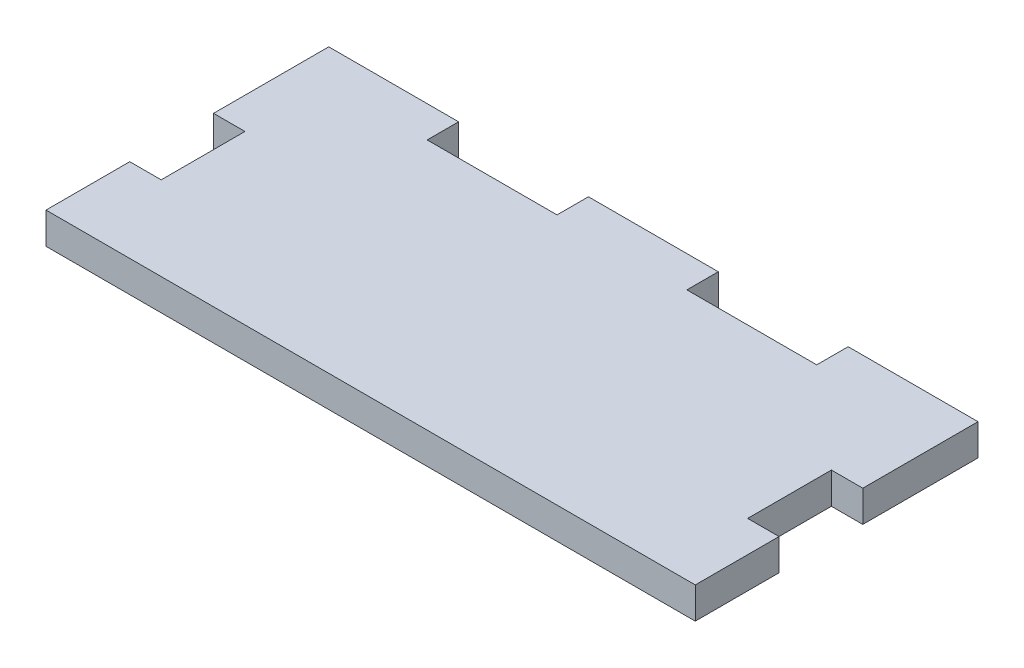
ISO-10303-21;
HEADER;
FILE_DESCRIPTION(('STEP AP214'),'2;1');
FILE_NAME('part.step','',(''),(''),'','','');
FILE_SCHEMA(('AUTOMOTIVE_DESIGN { 1 0 10303 214 1 1 1 1 }'));
ENDSEC;
DATA;
#1=APPLICATION_CONTEXT('core data for automotive mechanical design processes');
#2=APPLICATION_PROTOCOL_DEFINITION('international standard','automotive_design',2000,#1);
#3=PRODUCT_CONTEXT('',#1,'mechanical');
#4=PRODUCT('Part','Part','',(#3));
#5=PRODUCT_RELATED_PRODUCT_CATEGORY('part','',(#4));
#6=PRODUCT_DEFINITION_FORMATION('','',#4);
#7=PRODUCT_DEFINITION_CONTEXT('part definition',#1,'design');
#8=PRODUCT_DEFINITION('design','',#6,#7);
#9=PRODUCT_DEFINITION_SHAPE('','',#8);
#10=(LENGTH_UNIT() NAMED_UNIT(*) SI_UNIT(.MILLI.,.METRE.));
#11=(NAMED_UNIT(*) PLANE_ANGLE_UNIT() SI_UNIT($,.RADIAN.));
#12=(NAMED_UNIT(*) SI_UNIT($,.STERADIAN.) SOLID_ANGLE_UNIT());
#13=UNCERTAINTY_MEASURE_WITH_UNIT(LENGTH_MEASURE(1.E-05),#10,'distance_accuracy_value','');
#14=(GEOMETRIC_REPRESENTATION_CONTEXT(3) GLOBAL_UNCERTAINTY_ASSIGNED_CONTEXT((#13)) GLOBAL_UNIT_ASSIGNED_CONTEXT((#10,
#11,#12)) REPRESENTATION_CONTEXT('',''));
#15=CARTESIAN_POINT('',(0.,0.,0.));
#16=DIRECTION('',(0.,0.,1.));
#17=DIRECTION('',(1.,0.,0.));
#18=AXIS2_PLACEMENT_3D('',#15,#16,#17);
#19=CARTESIAN_POINT('',(0.,3.,-2.49999999999999));
#20=DIRECTION('',(0.,0.,-1.));
#21=DIRECTION('',(-1.,0.,0.));
#22=AXIS2_PLACEMENT_3D('',#19,#20,#21);
#23=PLANE('',#22);
#24=DIRECTION('',(1.,0.,0.));
#25=VECTOR('',#24,1.);
#26=CARTESIAN_POINT('',(0.,0.,-2.49999999999999));
#27=LINE('',#26,#25);
#28=CARTESIAN_POINT('',(28.,0.,-2.49999999999999));
#29=VERTEX_POINT('',#28);
#30=CARTESIAN_POINT('',(31.,0.,-2.49999999999999));
#31=VERTEX_POINT('',#30);
#32=EDGE_CURVE('E201',#29,#31,#27,.T.);
#33=ORIENTED_EDGE('',*,*,#32,.T.);
#34=DIRECTION('',(0.,-1.,0.));
#35=VECTOR('',#34,1.);
#36=CARTESIAN_POINT('',(31.,3.,-2.49999999999999));
#37=LINE('',#36,#35);
#38=CARTESIAN_POINT('',(31.,3.,-2.49999999999999));
#39=VERTEX_POINT('',#38);
#40=EDGE_CURVE('E11',#39,#31,#37,.T.);
#41=ORIENTED_EDGE('',*,*,#40,.F.);
#42=DIRECTION('',(1.,0.,0.));
#43=VECTOR('',#42,1.);
#44=CARTESIAN_POINT('',(0.,3.,-2.49999999999999));
#45=LINE('',#44,#43);
#46=CARTESIAN_POINT('',(28.,3.,-2.49999999999999));
#47=VERTEX_POINT('',#46);
#48=EDGE_CURVE('E252',#47,#39,#45,.T.);
#49=ORIENTED_EDGE('',*,*,#48,.F.);
#50=DIRECTION('',(0.,-1.,0.));
#51=VECTOR('',#50,1.);
#52=CARTESIAN_POINT('',(28.,3.,-2.49999999999999));
#53=LINE('',#52,#51);
#54=EDGE_CURVE('E197',#47,#29,#53,.T.);
#55=ORIENTED_EDGE('',*,*,#54,.T.);
#56=EDGE_LOOP('',(#33,#41,#49,#55));
#57=FACE_BOUND('',#56,.T.);
#58=ADVANCED_FACE('F33',(#57),#23,.F.);
#59=CARTESIAN_POINT('',(31.,3.,0.));
#60=DIRECTION('',(-1.,0.,0.));
#61=DIRECTION('',(0.,0.,1.));
#62=AXIS2_PLACEMENT_3D('',#59,#60,#61);
#63=PLANE('',#62);
#64=DIRECTION('',(0.,0.,-1.));
#65=VECTOR('',#64,1.);
#66=CARTESIAN_POINT('',(31.,0.,0.));
#67=LINE('',#66,#65);
#68=CARTESIAN_POINT('',(31.,0.,-13.5));
#69=VERTEX_POINT('',#68);
#70=EDGE_CURVE('E204',#31,#69,#67,.T.);
#71=ORIENTED_EDGE('',*,*,#70,.T.);
#72=DIRECTION('',(0.,-1.,0.));
#73=VECTOR('',#72,1.);
#74=CARTESIAN_POINT('',(31.,3.,-13.5));
#75=LINE('',#74,#73);
#76=CARTESIAN_POINT('',(31.,3.,-13.5));
#77=VERTEX_POINT('',#76);
#78=EDGE_CURVE('E41',#77,#69,#75,.T.);
#79=ORIENTED_EDGE('',*,*,#78,.F.);
#80=DIRECTION('',(0.,0.,-1.));
#81=VECTOR('',#80,1.);
#82=CARTESIAN_POINT('',(31.,3.,0.));
#83=LINE('',#82,#81);
#84=EDGE_CURVE('E128',#39,#77,#83,.T.);
#85=ORIENTED_EDGE('',*,*,#84,.F.);
#86=ORIENTED_EDGE('',*,*,#40,.T.);
#87=EDGE_LOOP('',(#71,#79,#85,#86));
#88=FACE_BOUND('',#87,.T.);
#89=ADVANCED_FACE('F359',(#88),#63,.F.);
#90=CARTESIAN_POINT('',(0.,3.,-13.5));
#91=DIRECTION('',(0.,0.,1.));
#92=DIRECTION('',(1.,0.,0.));
#93=AXIS2_PLACEMENT_3D('',#90,#91,#92);
#94=PLANE('',#93);
#95=DIRECTION('',(-1.,0.,0.));
#96=VECTOR('',#95,1.);
#97=CARTESIAN_POINT('',(0.,0.,-13.5));
#98=LINE('',#97,#96);
#99=CARTESIAN_POINT('',(18.6,0.,-13.5));
#100=VERTEX_POINT('',#99);
#101=EDGE_CURVE('E206',#69,#100,#98,.T.);
#102=ORIENTED_EDGE('',*,*,#101,.T.);
#103=DIRECTION('',(0.,-1.,0.));
#104=VECTOR('',#103,1.);
#105=CARTESIAN_POINT('',(18.6,3.,-13.5));
#106=LINE('',#105,#104);
#107=CARTESIAN_POINT('',(18.6,3.,-13.5));
#108=VERTEX_POINT('',#107);
#109=EDGE_CURVE('E283',#108,#100,#106,.T.);
#110=ORIENTED_EDGE('',*,*,#109,.F.);
#111=DIRECTION('',(-1.,0.,0.));
#112=VECTOR('',#111,1.);
#113=CARTESIAN_POINT('',(0.,3.,-13.5));
#114=LINE('',#113,#112);
#115=EDGE_CURVE('E291',#77,#108,#114,.T.);
#116=ORIENTED_EDGE('',*,*,#115,.F.);
#117=ORIENTED_EDGE('',*,*,#78,.T.);
#118=EDGE_LOOP('',(#102,#110,#116,#117));
#119=FACE_BOUND('',#118,.T.);
#120=ADVANCED_FACE('F289',(#119),#94,.F.);
#121=CARTESIAN_POINT('',(18.6,3.,0.));
#122=DIRECTION('',(1.,0.,0.));
#123=DIRECTION('',(0.,0.,-1.));
#124=AXIS2_PLACEMENT_3D('',#121,#122,#123);
#125=PLANE('',#124);
#126=DIRECTION('',(0.,0.,1.));
#127=VECTOR('',#126,1.);
#128=CARTESIAN_POINT('',(18.6,0.,0.));
#129=LINE('',#128,#127);
#130=CARTESIAN_POINT('',(18.6,0.,-10.5));
#131=VERTEX_POINT('',#130);
#132=EDGE_CURVE('E208',#100,#131,#129,.T.);
#133=ORIENTED_EDGE('',*,*,#132,.T.);
#134=DIRECTION('',(0.,-1.,0.));
#135=VECTOR('',#134,1.);
#136=CARTESIAN_POINT('',(18.6,3.,-10.5));
#137=LINE('',#136,#135);
#138=CARTESIAN_POINT('',(18.6,3.,-10.5));
#139=VERTEX_POINT('',#138);
#140=EDGE_CURVE('E281',#139,#131,#137,.T.);
#141=ORIENTED_EDGE('',*,*,#140,.F.);
#142=DIRECTION('',(0.,0.,1.));
#143=VECTOR('',#142,1.);
#144=CARTESIAN_POINT('',(18.6,3.,0.));
#145=LINE('',#144,#143);
#146=EDGE_CURVE('E303',#108,#139,#145,.T.);
#147=ORIENTED_EDGE('',*,*,#146,.F.);
#148=ORIENTED_EDGE('',*,*,#109,.T.);
#149=EDGE_LOOP('',(#133,#141,#147,#148));
#150=FACE_BOUND('',#149,.T.);
#151=ADVANCED_FACE('F300',(#150),#125,.F.);
#152=CARTESIAN_POINT('',(0.,3.,-10.5));
#153=DIRECTION('',(0.,0.,-1.));
#154=DIRECTION('',(-1.,0.,0.));
#155=AXIS2_PLACEMENT_3D('',#152,#153,#154);
#156=PLANE('',#155);
#157=DIRECTION('',(1.,0.,0.));
#158=VECTOR('',#157,1.);
#159=CARTESIAN_POINT('',(0.,0.,-10.5));
#160=LINE('',#159,#158);
#161=CARTESIAN_POINT('',(6.2,0.,-10.5));
#162=VERTEX_POINT('',#161);
#163=EDGE_CURVE('E211',#162,#131,#160,.T.);
#164=ORIENTED_EDGE('',*,*,#163,.F.);
#165=DIRECTION('',(0.,-1.,0.));
#166=VECTOR('',#165,1.);
#167=CARTESIAN_POINT('',(6.2,3.,-10.5));
#168=LINE('',#167,#166);
#169=CARTESIAN_POINT('',(6.2,3.,-10.5));
#170=VERTEX_POINT('',#169);
#171=EDGE_CURVE('E279',#170,#162,#168,.T.);
#172=ORIENTED_EDGE('',*,*,#171,.F.);
#173=DIRECTION('',(1.,0.,0.));
#174=VECTOR('',#173,1.);
#175=CARTESIAN_POINT('',(0.,3.,-10.5));
#176=LINE('',#175,#174);
#177=EDGE_CURVE('E305',#170,#139,#176,.T.);
#178=ORIENTED_EDGE('',*,*,#177,.T.);
#179=ORIENTED_EDGE('',*,*,#140,.T.);
#180=EDGE_LOOP('',(#164,#172,#178,#179));
#181=FACE_BOUND('',#180,.T.);
#182=ADVANCED_FACE('F370',(#181),#156,.T.);
#183=CARTESIAN_POINT('',(6.2,3.,0.));
#184=DIRECTION('',(-1.,0.,0.));
#185=DIRECTION('',(0.,0.,1.));
#186=AXIS2_PLACEMENT_3D('',#183,#184,#185);
#187=PLANE('',#186);
#188=DIRECTION('',(0.,0.,-1.));
#189=VECTOR('',#188,1.);
#190=CARTESIAN_POINT('',(6.2,0.,0.));
#191=LINE('',#190,#189);
#192=CARTESIAN_POINT('',(6.2,0.,-13.5));
#193=VERTEX_POINT('',#192);
#194=EDGE_CURVE('E214',#162,#193,#191,.T.);
#195=ORIENTED_EDGE('',*,*,#194,.T.);
#196=DIRECTION('',(0.,-1.,0.));
#197=VECTOR('',#196,1.);
#198=CARTESIAN_POINT('',(6.2,3.,-13.5));
#199=LINE('',#198,#197);
#200=CARTESIAN_POINT('',(6.2,3.,-13.5));
#201=VERTEX_POINT('',#200);
#202=EDGE_CURVE('E276',#201,#193,#199,.T.);
#203=ORIENTED_EDGE('',*,*,#202,.F.);
#204=DIRECTION('',(0.,0.,-1.));
#205=VECTOR('',#204,1.);
#206=CARTESIAN_POINT('',(6.2,3.,0.));
#207=LINE('',#206,#205);
#208=EDGE_CURVE('E307',#170,#201,#207,.T.);
#209=ORIENTED_EDGE('',*,*,#208,.F.);
#210=ORIENTED_EDGE('',*,*,#171,.T.);
#211=EDGE_LOOP('',(#195,#203,#209,#210));
#212=FACE_BOUND('',#211,.T.);
#213=ADVANCED_FACE('F373',(#212),#187,.F.);
#214=CARTESIAN_POINT('',(0.,3.,-13.5));
#215=DIRECTION('',(0.,0.,1.));
#216=DIRECTION('',(1.,0.,0.));
#217=AXIS2_PLACEMENT_3D('',#214,#215,#216);
#218=PLANE('',#217);
#219=DIRECTION('',(-1.,0.,0.));
#220=VECTOR('',#219,1.);
#221=CARTESIAN_POINT('',(0.,0.,-13.5));
#222=LINE('',#221,#220);
#223=CARTESIAN_POINT('',(-6.2,0.,-13.5));
#224=VERTEX_POINT('',#223);
#225=EDGE_CURVE('E216',#193,#224,#222,.T.);
#226=ORIENTED_EDGE('',*,*,#225,.T.);
#227=DIRECTION('',(0.,-1.,0.));
#228=VECTOR('',#227,1.);
#229=CARTESIAN_POINT('',(-6.2,3.,-13.5));
#230=LINE('',#229,#228);
#231=CARTESIAN_POINT('',(-6.2,3.,-13.5));
#232=VERTEX_POINT('',#231);
#233=EDGE_CURVE('E274',#232,#224,#230,.T.);
#234=ORIENTED_EDGE('',*,*,#233,.F.);
#235=DIRECTION('',(-1.,0.,0.));
#236=VECTOR('',#235,1.);
#237=CARTESIAN_POINT('',(0.,3.,-13.5));
#238=LINE('',#237,#236);
#239=EDGE_CURVE('E313',#201,#232,#238,.T.);
#240=ORIENTED_EDGE('',*,*,#239,.F.);
#241=ORIENTED_EDGE('',*,*,#202,.T.);
#242=EDGE_LOOP('',(#226,#234,#240,#241));
#243=FACE_BOUND('',#242,.T.);
#244=ADVANCED_FACE('F377',(#243),#218,.F.);
#245=CARTESIAN_POINT('',(-6.2,3.,0.));
#246=DIRECTION('',(-1.,0.,0.));
#247=DIRECTION('',(0.,0.,1.));
#248=AXIS2_PLACEMENT_3D('',#245,#246,#247);
#249=PLANE('',#248);
#250=DIRECTION('',(0.,0.,-1.));
#251=VECTOR('',#250,1.);
#252=CARTESIAN_POINT('',(-6.2,0.,0.));
#253=LINE('',#252,#251);
#254=CARTESIAN_POINT('',(-6.2,0.,-10.5));
#255=VERTEX_POINT('',#254);
#256=EDGE_CURVE('E219',#255,#224,#253,.T.);
#257=ORIENTED_EDGE('',*,*,#256,.F.);
#258=DIRECTION('',(0.,-1.,0.));
#259=VECTOR('',#258,1.);
#260=CARTESIAN_POINT('',(-6.2,3.,-10.5));
#261=LINE('',#260,#259);
#262=CARTESIAN_POINT('',(-6.2,3.,-10.5));
#263=VERTEX_POINT('',#262);
#264=EDGE_CURVE('E272',#263,#255,#261,.T.);
#265=ORIENTED_EDGE('',*,*,#264,.F.);
#266=DIRECTION('',(0.,0.,-1.));
#267=VECTOR('',#266,1.);
#268=CARTESIAN_POINT('',(-6.2,3.,0.));
#269=LINE('',#268,#267);
#270=EDGE_CURVE('E315',#263,#232,#269,.T.);
#271=ORIENTED_EDGE('',*,*,#270,.T.);
#272=ORIENTED_EDGE('',*,*,#233,.T.);
#273=EDGE_LOOP('',(#257,#265,#271,#272));
#274=FACE_BOUND('',#273,.T.);
#275=ADVANCED_FACE('F381',(#274),#249,.T.);
#276=CARTESIAN_POINT('',(0.,3.,-10.5));
#277=DIRECTION('',(0.,0.,-1.));
#278=DIRECTION('',(-1.,0.,0.));
#279=AXIS2_PLACEMENT_3D('',#276,#277,#278);
#280=PLANE('',#279);
#281=DIRECTION('',(1.,0.,0.));
#282=VECTOR('',#281,1.);
#283=CARTESIAN_POINT('',(0.,0.,-10.5));
#284=LINE('',#283,#282);
#285=CARTESIAN_POINT('',(-18.6,0.,-10.5));
#286=VERTEX_POINT('',#285);
#287=EDGE_CURVE('E222',#286,#255,#284,.T.);
#288=ORIENTED_EDGE('',*,*,#287,.F.);
#289=DIRECTION('',(0.,-1.,0.));
#290=VECTOR('',#289,1.);
#291=CARTESIAN_POINT('',(-18.6,3.,-10.5));
#292=LINE('',#291,#290);
#293=CARTESIAN_POINT('',(-18.6,3.,-10.5));
#294=VERTEX_POINT('',#293);
#295=EDGE_CURVE('E270',#294,#286,#292,.T.);
#296=ORIENTED_EDGE('',*,*,#295,.F.);
#297=DIRECTION('',(1.,0.,0.));
#298=VECTOR('',#297,1.);
#299=CARTESIAN_POINT('',(0.,3.,-10.5));
#300=LINE('',#299,#298);
#301=EDGE_CURVE('E318',#294,#263,#300,.T.);
#302=ORIENTED_EDGE('',*,*,#301,.T.);
#303=ORIENTED_EDGE('',*,*,#264,.T.);
#304=EDGE_LOOP('',(#288,#296,#302,#303));
#305=FACE_BOUND('',#304,.T.);
#306=ADVANCED_FACE('F385',(#305),#280,.T.);
#307=CARTESIAN_POINT('',(-18.6,3.,0.));
#308=DIRECTION('',(1.,0.,0.));
#309=DIRECTION('',(0.,0.,-1.));
#310=AXIS2_PLACEMENT_3D('',#307,#308,#309);
#311=PLANE('',#310);
#312=DIRECTION('',(0.,0.,1.));
#313=VECTOR('',#312,1.);
#314=CARTESIAN_POINT('',(-18.6,0.,0.));
#315=LINE('',#314,#313);
#316=CARTESIAN_POINT('',(-18.6,0.,-13.5));
#317=VERTEX_POINT('',#316);
#318=EDGE_CURVE('E225',#317,#286,#315,.T.);
#319=ORIENTED_EDGE('',*,*,#318,.F.);
#320=DIRECTION('',(0.,-1.,0.));
#321=VECTOR('',#320,1.);
#322=CARTESIAN_POINT('',(-18.6,3.,-13.5));
#323=LINE('',#322,#321);
#324=CARTESIAN_POINT('',(-18.6,3.,-13.5));
#325=VERTEX_POINT('',#324);
#326=EDGE_CURVE('E268',#325,#317,#323,.T.);
#327=ORIENTED_EDGE('',*,*,#326,.F.);
#328=DIRECTION('',(0.,0.,1.));
#329=VECTOR('',#328,1.);
#330=CARTESIAN_POINT('',(-18.6,3.,0.));
#331=LINE('',#330,#329);
#332=EDGE_CURVE('E321',#325,#294,#331,.T.);
#333=ORIENTED_EDGE('',*,*,#332,.T.);
#334=ORIENTED_EDGE('',*,*,#295,.T.);
#335=EDGE_LOOP('',(#319,#327,#333,#334));
#336=FACE_BOUND('',#335,.T.);
#337=ADVANCED_FACE('F389',(#336),#311,.T.);
#338=CARTESIAN_POINT('',(0.,3.,-13.5));
#339=DIRECTION('',(0.,0.,-1.));
#340=DIRECTION('',(-1.,0.,0.));
#341=AXIS2_PLACEMENT_3D('',#338,#339,#340);
#342=PLANE('',#341);
#343=DIRECTION('',(1.,0.,0.));
#344=VECTOR('',#343,1.);
#345=CARTESIAN_POINT('',(0.,0.,-13.5));
#346=LINE('',#345,#344);
#347=CARTESIAN_POINT('',(-31.,0.,-13.5));
#348=VERTEX_POINT('',#347);
#349=EDGE_CURVE('E228',#348,#317,#346,.T.);
#350=ORIENTED_EDGE('',*,*,#349,.F.);
#351=DIRECTION('',(0.,-1.,0.));
#352=VECTOR('',#351,1.);
#353=CARTESIAN_POINT('',(-31.,3.,-13.5));
#354=LINE('',#353,#352);
#355=CARTESIAN_POINT('',(-31.,3.,-13.5));
#356=VERTEX_POINT('',#355);
#357=EDGE_CURVE('E266',#356,#348,#354,.T.);
#358=ORIENTED_EDGE('',*,*,#357,.F.);
#359=DIRECTION('',(1.,0.,0.));
#360=VECTOR('',#359,1.);
#361=CARTESIAN_POINT('',(0.,3.,-13.5));
#362=LINE('',#361,#360);
#363=EDGE_CURVE('E324',#356,#325,#362,.T.);
#364=ORIENTED_EDGE('',*,*,#363,.T.);
#365=ORIENTED_EDGE('',*,*,#326,.T.);
#366=EDGE_LOOP('',(#350,#358,#364,#365));
#367=FACE_BOUND('',#366,.T.);
#368=ADVANCED_FACE('F393',(#367),#342,.T.);
#369=CARTESIAN_POINT('',(-31.,3.,0.));
#370=DIRECTION('',(-1.,0.,0.));
#371=DIRECTION('',(0.,0.,1.));
#372=AXIS2_PLACEMENT_3D('',#369,#370,#371);
#373=PLANE('',#372);
#374=DIRECTION('',(0.,0.,-1.));
#375=VECTOR('',#374,1.);
#376=CARTESIAN_POINT('',(-31.,0.,0.));
#377=LINE('',#376,#375);
#378=CARTESIAN_POINT('',(-31.,0.,-2.5));
#379=VERTEX_POINT('',#378);
#380=EDGE_CURVE('E231',#379,#348,#377,.T.);
#381=ORIENTED_EDGE('',*,*,#380,.F.);
#382=DIRECTION('',(0.,-1.,0.));
#383=VECTOR('',#382,1.);
#384=CARTESIAN_POINT('',(-31.,3.,-2.5));
#385=LINE('',#384,#383);
#386=CARTESIAN_POINT('',(-31.,3.,-2.5));
#387=VERTEX_POINT('',#386);
#388=EDGE_CURVE('E264',#387,#379,#385,.T.);
#389=ORIENTED_EDGE('',*,*,#388,.F.);
#390=DIRECTION('',(0.,0.,-1.));
#391=VECTOR('',#390,1.);
#392=CARTESIAN_POINT('',(-31.,3.,0.));
#393=LINE('',#392,#391);
#394=EDGE_CURVE('E327',#387,#356,#393,.T.);
#395=ORIENTED_EDGE('',*,*,#394,.T.);
#396=ORIENTED_EDGE('',*,*,#357,.T.);
#397=EDGE_LOOP('',(#381,#389,#395,#396));
#398=FACE_BOUND('',#397,.T.);
#399=ADVANCED_FACE('F397',(#398),#373,.T.);
#400=CARTESIAN_POINT('',(0.,3.,-2.5));
#401=DIRECTION('',(0.,0.,1.));
#402=DIRECTION('',(1.,0.,0.));
#403=AXIS2_PLACEMENT_3D('',#400,#401,#402);
#404=PLANE('',#403);
#405=DIRECTION('',(-1.,0.,0.));
#406=VECTOR('',#405,1.);
#407=CARTESIAN_POINT('',(0.,0.,-2.5));
#408=LINE('',#407,#406);
#409=CARTESIAN_POINT('',(-28.,0.,-2.5));
#410=VERTEX_POINT('',#409);
#411=EDGE_CURVE('E234',#410,#379,#408,.T.);
#412=ORIENTED_EDGE('',*,*,#411,.F.);
#413=DIRECTION('',(0.,-1.,0.));
#414=VECTOR('',#413,1.);
#415=CARTESIAN_POINT('',(-28.,3.,-2.5));
#416=LINE('',#415,#414);
#417=CARTESIAN_POINT('',(-28.,3.,-2.5));
#418=VERTEX_POINT('',#417);
#419=EDGE_CURVE('E262',#418,#410,#416,.T.);
#420=ORIENTED_EDGE('',*,*,#419,.F.);
#421=DIRECTION('',(-1.,0.,0.));
#422=VECTOR('',#421,1.);
#423=CARTESIAN_POINT('',(0.,3.,-2.5));
#424=LINE('',#423,#422);
#425=EDGE_CURVE('E330',#418,#387,#424,.T.);
#426=ORIENTED_EDGE('',*,*,#425,.T.);
#427=ORIENTED_EDGE('',*,*,#388,.T.);
#428=EDGE_LOOP('',(#412,#420,#426,#427));
#429=FACE_BOUND('',#428,.T.);
#430=ADVANCED_FACE('F401',(#429),#404,.T.);
#431=CARTESIAN_POINT('',(-28.,3.,0.));
#432=DIRECTION('',(-1.,0.,0.));
#433=DIRECTION('',(0.,0.,1.));
#434=AXIS2_PLACEMENT_3D('',#431,#432,#433);
#435=PLANE('',#434);
#436=DIRECTION('',(0.,0.,-1.));
#437=VECTOR('',#436,1.);
#438=CARTESIAN_POINT('',(-28.,0.,0.));
#439=LINE('',#438,#437);
#440=CARTESIAN_POINT('',(-28.,0.,5.5));
#441=VERTEX_POINT('',#440);
#442=EDGE_CURVE('E237',#441,#410,#439,.T.);
#443=ORIENTED_EDGE('',*,*,#442,.F.);
#444=DIRECTION('',(0.,-1.,0.));
#445=VECTOR('',#444,1.);
#446=CARTESIAN_POINT('',(-28.,3.,5.5));
#447=LINE('',#446,#445);
#448=CARTESIAN_POINT('',(-28.,3.,5.5));
#449=VERTEX_POINT('',#448);
#450=EDGE_CURVE('E260',#449,#441,#447,.T.);
#451=ORIENTED_EDGE('',*,*,#450,.F.);
#452=DIRECTION('',(0.,0.,-1.));
#453=VECTOR('',#452,1.);
#454=CARTESIAN_POINT('',(-28.,3.,0.));
#455=LINE('',#454,#453);
#456=EDGE_CURVE('E333',#449,#418,#455,.T.);
#457=ORIENTED_EDGE('',*,*,#456,.T.);
#458=ORIENTED_EDGE('',*,*,#419,.T.);
#459=EDGE_LOOP('',(#443,#451,#457,#458));
#460=FACE_BOUND('',#459,.T.);
#461=ADVANCED_FACE('F405',(#460),#435,.T.);
#462=CARTESIAN_POINT('',(0.,3.,5.5));
#463=DIRECTION('',(0.,0.,-1.));
#464=DIRECTION('',(-1.,0.,0.));
#465=AXIS2_PLACEMENT_3D('',#462,#463,#464);
#466=PLANE('',#465);
#467=DIRECTION('',(1.,0.,0.));
#468=VECTOR('',#467,1.);
#469=CARTESIAN_POINT('',(0.,0.,5.5));
#470=LINE('',#469,#468);
#471=CARTESIAN_POINT('',(-31.,0.,5.5));
#472=VERTEX_POINT('',#471);
#473=EDGE_CURVE('E240',#472,#441,#470,.T.);
#474=ORIENTED_EDGE('',*,*,#473,.F.);
#475=DIRECTION('',(0.,-1.,0.));
#476=VECTOR('',#475,1.);
#477=CARTESIAN_POINT('',(-31.,3.,5.5));
#478=LINE('',#477,#476);
#479=CARTESIAN_POINT('',(-31.,3.,5.5));
#480=VERTEX_POINT('',#479);
#481=EDGE_CURVE('E258',#480,#472,#478,.T.);
#482=ORIENTED_EDGE('',*,*,#481,.F.);
#483=DIRECTION('',(1.,0.,0.));
#484=VECTOR('',#483,1.);
#485=CARTESIAN_POINT('',(0.,3.,5.5));
#486=LINE('',#485,#484);
#487=EDGE_CURVE('E336',#480,#449,#486,.T.);
#488=ORIENTED_EDGE('',*,*,#487,.T.);
#489=ORIENTED_EDGE('',*,*,#450,.T.);
#490=EDGE_LOOP('',(#474,#482,#488,#489));
#491=FACE_BOUND('',#490,.T.);
#492=ADVANCED_FACE('F409',(#491),#466,.T.);
#493=CARTESIAN_POINT('',(-31.,3.,0.));
#494=DIRECTION('',(-1.,0.,0.));
#495=DIRECTION('',(0.,0.,1.));
#496=AXIS2_PLACEMENT_3D('',#493,#494,#495);
#497=PLANE('',#496);
#498=DIRECTION('',(0.,0.,-1.));
#499=VECTOR('',#498,1.);
#500=CARTESIAN_POINT('',(-31.,0.,0.));
#501=LINE('',#500,#499);
#502=CARTESIAN_POINT('',(-31.,0.,13.5));
#503=VERTEX_POINT('',#502);
#504=EDGE_CURVE('E243',#503,#472,#501,.T.);
#505=ORIENTED_EDGE('',*,*,#504,.F.);
#506=DIRECTION('',(0.,-1.,0.));
#507=VECTOR('',#506,1.);
#508=CARTESIAN_POINT('',(-31.,3.,13.5));
#509=LINE('',#508,#507);
#510=CARTESIAN_POINT('',(-31.,3.,13.5));
#511=VERTEX_POINT('',#510);
#512=EDGE_CURVE('E256',#511,#503,#509,.T.);
#513=ORIENTED_EDGE('',*,*,#512,.F.);
#514=DIRECTION('',(0.,0.,-1.));
#515=VECTOR('',#514,1.);
#516=CARTESIAN_POINT('',(-31.,3.,0.));
#517=LINE('',#516,#515);
#518=EDGE_CURVE('E339',#511,#480,#517,.T.);
#519=ORIENTED_EDGE('',*,*,#518,.T.);
#520=ORIENTED_EDGE('',*,*,#481,.T.);
#521=EDGE_LOOP('',(#505,#513,#519,#520));
#522=FACE_BOUND('',#521,.T.);
#523=ADVANCED_FACE('F413',(#522),#497,.T.);
#524=CARTESIAN_POINT('',(0.,3.,13.5));
#525=DIRECTION('',(0.,0.,1.));
#526=DIRECTION('',(1.,0.,0.));
#527=AXIS2_PLACEMENT_3D('',#524,#525,#526);
#528=PLANE('',#527);
#529=DIRECTION('',(-1.,0.,0.));
#530=VECTOR('',#529,1.);
#531=CARTESIAN_POINT('',(0.,0.,13.5));
#532=LINE('',#531,#530);
#533=CARTESIAN_POINT('',(31.,0.,13.5));
#534=VERTEX_POINT('',#533);
#535=EDGE_CURVE('E246',#534,#503,#532,.T.);
#536=ORIENTED_EDGE('',*,*,#535,.F.);
#537=DIRECTION('',(0.,-1.,0.));
#538=VECTOR('',#537,1.);
#539=CARTESIAN_POINT('',(31.,3.,13.5));
#540=LINE('',#539,#538);
#541=CARTESIAN_POINT('',(31.,3.,13.5));
#542=VERTEX_POINT('',#541);
#543=EDGE_CURVE('E192',#542,#534,#540,.T.);
#544=ORIENTED_EDGE('',*,*,#543,.F.);
#545=DIRECTION('',(-1.,0.,0.));
#546=VECTOR('',#545,1.);
#547=CARTESIAN_POINT('',(0.,3.,13.5));
#548=LINE('',#547,#546);
#549=EDGE_CURVE('E185',#542,#511,#548,.T.);
#550=ORIENTED_EDGE('',*,*,#549,.T.);
#551=ORIENTED_EDGE('',*,*,#512,.T.);
#552=EDGE_LOOP('',(#536,#544,#550,#551));
#553=FACE_BOUND('',#552,.T.);
#554=ADVANCED_FACE('F343',(#553),#528,.T.);
#555=CARTESIAN_POINT('',(31.,3.,0.));
#556=DIRECTION('',(-1.,0.,0.));
#557=DIRECTION('',(0.,0.,1.));
#558=AXIS2_PLACEMENT_3D('',#555,#556,#557);
#559=PLANE('',#558);
#560=DIRECTION('',(0.,0.,-1.));
#561=VECTOR('',#560,1.);
#562=CARTESIAN_POINT('',(31.,0.,0.));
#563=LINE('',#562,#561);
#564=CARTESIAN_POINT('',(31.,0.,5.50000000000001));
#565=VERTEX_POINT('',#564);
#566=EDGE_CURVE('E191',#534,#565,#563,.T.);
#567=ORIENTED_EDGE('',*,*,#566,.T.);
#568=DIRECTION('',(0.,-1.,0.));
#569=VECTOR('',#568,1.);
#570=CARTESIAN_POINT('',(31.,3.,5.50000000000001));
#571=LINE('',#570,#569);
#572=CARTESIAN_POINT('',(31.,3.,5.50000000000001));
#573=VERTEX_POINT('',#572);
#574=EDGE_CURVE('E188',#573,#565,#571,.T.);
#575=ORIENTED_EDGE('',*,*,#574,.F.);
#576=DIRECTION('',(0.,0.,-1.));
#577=VECTOR('',#576,1.);
#578=CARTESIAN_POINT('',(31.,3.,0.));
#579=LINE('',#578,#577);
#580=EDGE_CURVE('E178',#542,#573,#579,.T.);
#581=ORIENTED_EDGE('',*,*,#580,.F.);
#582=ORIENTED_EDGE('',*,*,#543,.T.);
#583=EDGE_LOOP('',(#567,#575,#581,#582));
#584=FACE_BOUND('',#583,.T.);
#585=ADVANCED_FACE('F189',(#584),#559,.F.);
#586=CARTESIAN_POINT('',(0.,3.,5.50000000000001));
#587=DIRECTION('',(0.,0.,1.));
#588=DIRECTION('',(1.,0.,0.));
#589=AXIS2_PLACEMENT_3D('',#586,#587,#588);
#590=PLANE('',#589);
#591=DIRECTION('',(-1.,0.,0.));
#592=VECTOR('',#591,1.);
#593=CARTESIAN_POINT('',(0.,0.,5.50000000000001));
#594=LINE('',#593,#592);
#595=CARTESIAN_POINT('',(28.,0.,5.50000000000001));
#596=VERTEX_POINT('',#595);
#597=EDGE_CURVE('E114',#565,#596,#594,.T.);
#598=ORIENTED_EDGE('',*,*,#597,.T.);
#599=DIRECTION('',(0.,-1.,0.));
#600=VECTOR('',#599,1.);
#601=CARTESIAN_POINT('',(28.,3.,5.50000000000001));
#602=LINE('',#601,#600);
#603=CARTESIAN_POINT('',(28.,3.,5.50000000000001));
#604=VERTEX_POINT('',#603);
#605=EDGE_CURVE('E193',#604,#596,#602,.T.);
#606=ORIENTED_EDGE('',*,*,#605,.F.);
#607=DIRECTION('',(-1.,0.,0.));
#608=VECTOR('',#607,1.);
#609=CARTESIAN_POINT('',(0.,3.,5.50000000000001));
#610=LINE('',#609,#608);
#611=EDGE_CURVE('E182',#573,#604,#610,.T.);
#612=ORIENTED_EDGE('',*,*,#611,.F.);
#613=ORIENTED_EDGE('',*,*,#574,.T.);
#614=EDGE_LOOP('',(#598,#606,#612,#613));
#615=FACE_BOUND('',#614,.T.);
#616=ADVANCED_FACE('F195',(#615),#590,.F.);
#617=CARTESIAN_POINT('',(28.,3.,0.));
#618=DIRECTION('',(-1.,0.,0.));
#619=DIRECTION('',(0.,0.,1.));
#620=AXIS2_PLACEMENT_3D('',#617,#618,#619);
#621=PLANE('',#620);
#622=DIRECTION('',(0.,0.,-1.));
#623=VECTOR('',#622,1.);
#624=CARTESIAN_POINT('',(28.,0.,0.));
#625=LINE('',#624,#623);
#626=EDGE_CURVE('E120',#596,#29,#625,.T.);
#627=ORIENTED_EDGE('',*,*,#626,.T.);
#628=ORIENTED_EDGE('',*,*,#54,.F.);
#629=DIRECTION('',(0.,0.,-1.));
#630=VECTOR('',#629,1.);
#631=CARTESIAN_POINT('',(28.,3.,0.));
#632=LINE('',#631,#630);
#633=EDGE_CURVE('E49',#604,#47,#632,.T.);
#634=ORIENTED_EDGE('',*,*,#633,.F.);
#635=ORIENTED_EDGE('',*,*,#605,.T.);
#636=EDGE_LOOP('',(#627,#628,#634,#635));
#637=FACE_BOUND('',#636,.T.);
#638=ADVANCED_FACE('F348',(#637),#621,.F.);
#639=CARTESIAN_POINT('',(0.,3.,0.));
#640=DIRECTION('',(0.,1.,0.));
#641=DIRECTION('',(0.,0.,1.));
#642=AXIS2_PLACEMENT_3D('',#639,#640,#641);
#643=PLANE('',#642);
#644=ORIENTED_EDGE('',*,*,#48,.T.);
#645=ORIENTED_EDGE('',*,*,#84,.T.);
#646=ORIENTED_EDGE('',*,*,#115,.T.);
#647=ORIENTED_EDGE('',*,*,#146,.T.);
#648=ORIENTED_EDGE('',*,*,#177,.F.);
#649=ORIENTED_EDGE('',*,*,#208,.T.);
#650=ORIENTED_EDGE('',*,*,#239,.T.);
#651=ORIENTED_EDGE('',*,*,#270,.F.);
#652=ORIENTED_EDGE('',*,*,#301,.F.);
#653=ORIENTED_EDGE('',*,*,#332,.F.);
#654=ORIENTED_EDGE('',*,*,#363,.F.);
#655=ORIENTED_EDGE('',*,*,#394,.F.);
#656=ORIENTED_EDGE('',*,*,#425,.F.);
#657=ORIENTED_EDGE('',*,*,#456,.F.);
#658=ORIENTED_EDGE('',*,*,#487,.F.);
#659=ORIENTED_EDGE('',*,*,#518,.F.);
#660=ORIENTED_EDGE('',*,*,#549,.F.);
#661=ORIENTED_EDGE('',*,*,#580,.T.);
#662=ORIENTED_EDGE('',*,*,#611,.T.);
#663=ORIENTED_EDGE('',*,*,#633,.T.);
#664=EDGE_LOOP('',(#644,#645,#646,#647,#648,#649,#650,#651,#652,#653,#654,#655,#656,#657,#658,
#659,#660,#661,#662,#663));
#665=FACE_BOUND('',#664,.T.);
#666=ADVANCED_FACE('F180',(#665),#643,.T.);
#667=CARTESIAN_POINT('',(0.,0.,0.));
#668=DIRECTION('',(0.,1.,0.));
#669=DIRECTION('',(0.,0.,1.));
#670=AXIS2_PLACEMENT_3D('',#667,#668,#669);
#671=PLANE('',#670);
#672=ORIENTED_EDGE('',*,*,#32,.F.);
#673=ORIENTED_EDGE('',*,*,#626,.F.);
#674=ORIENTED_EDGE('',*,*,#597,.F.);
#675=ORIENTED_EDGE('',*,*,#566,.F.);
#676=ORIENTED_EDGE('',*,*,#535,.T.);
#677=ORIENTED_EDGE('',*,*,#504,.T.);
#678=ORIENTED_EDGE('',*,*,#473,.T.);
#679=ORIENTED_EDGE('',*,*,#442,.T.);
#680=ORIENTED_EDGE('',*,*,#411,.T.);
#681=ORIENTED_EDGE('',*,*,#380,.T.);
#682=ORIENTED_EDGE('',*,*,#349,.T.);
#683=ORIENTED_EDGE('',*,*,#318,.T.);
#684=ORIENTED_EDGE('',*,*,#287,.T.);
#685=ORIENTED_EDGE('',*,*,#256,.T.);
#686=ORIENTED_EDGE('',*,*,#225,.F.);
#687=ORIENTED_EDGE('',*,*,#194,.F.);
#688=ORIENTED_EDGE('',*,*,#163,.T.);
#689=ORIENTED_EDGE('',*,*,#132,.F.);
#690=ORIENTED_EDGE('',*,*,#101,.F.);
#691=ORIENTED_EDGE('',*,*,#70,.F.);
#692=EDGE_LOOP('',(#672,#673,#674,#675,#676,#677,#678,#679,#680,#681,#682,#683,#684,#685,#686,
#687,#688,#689,#690,#691));
#693=FACE_BOUND('',#692,.T.);
#694=ADVANCED_FACE('F295',(#693),#671,.F.);
#695=CLOSED_SHELL('',(#58,#89,#120,#151,#182,#213,#244,#275,#306,#337,#368,#399,#430,#461,#492,
#523,#554,#585,#616,#638,#666,#694));
#696=MANIFOLD_SOLID_BREP('B2',#695);
#697=ADVANCED_BREP_SHAPE_REPRESENTATION('',(#18,#696),#14);
#698=SHAPE_DEFINITION_REPRESENTATION(#9,#697);
ENDSEC;
END-ISO-10303-21;
